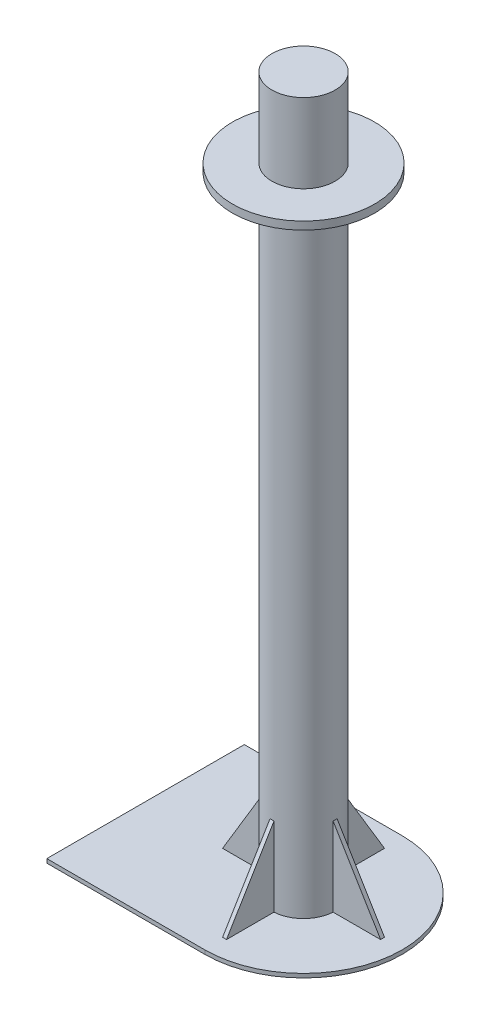
ISO-10303-21;
HEADER;
FILE_DESCRIPTION(('STEP AP214'),'2;1');
FILE_NAME('part.step','',(''),(''),'','','');
FILE_SCHEMA(('AUTOMOTIVE_DESIGN { 1 0 10303 214 1 1 1 1 }'));
ENDSEC;
DATA;
#1=APPLICATION_CONTEXT('core data for automotive mechanical design processes');
#2=APPLICATION_PROTOCOL_DEFINITION('international standard','automotive_design',2000,#1);
#3=PRODUCT_CONTEXT('',#1,'mechanical');
#4=PRODUCT('Part','Part','',(#3));
#5=PRODUCT_RELATED_PRODUCT_CATEGORY('part','',(#4));
#6=PRODUCT_DEFINITION_FORMATION('','',#4);
#7=PRODUCT_DEFINITION_CONTEXT('part definition',#1,'design');
#8=PRODUCT_DEFINITION('design','',#6,#7);
#9=PRODUCT_DEFINITION_SHAPE('','',#8);
#10=(LENGTH_UNIT() NAMED_UNIT(*) SI_UNIT(.MILLI.,.METRE.));
#11=(NAMED_UNIT(*) PLANE_ANGLE_UNIT() SI_UNIT($,.RADIAN.));
#12=(NAMED_UNIT(*) SI_UNIT($,.STERADIAN.) SOLID_ANGLE_UNIT());
#13=UNCERTAINTY_MEASURE_WITH_UNIT(LENGTH_MEASURE(1.E-05),#10,'distance_accuracy_value','');
#14=(GEOMETRIC_REPRESENTATION_CONTEXT(3) GLOBAL_UNCERTAINTY_ASSIGNED_CONTEXT((#13)) GLOBAL_UNIT_ASSIGNED_CONTEXT((#10,
#11,#12)) REPRESENTATION_CONTEXT('',''));
#15=CARTESIAN_POINT('',(0.,0.,0.));
#16=DIRECTION('',(0.,0.,1.));
#17=DIRECTION('',(1.,0.,0.));
#18=AXIS2_PLACEMENT_3D('',#15,#16,#17);
#19=CARTESIAN_POINT('',(99.9999999999998,805.,0.));
#20=DIRECTION('',(0.,1.,0.));
#21=DIRECTION('',(0.,0.,1.));
#22=AXIS2_PLACEMENT_3D('',#19,#20,#21);
#23=PLANE('',#22);
#24=CARTESIAN_POINT('',(99.9999999999998,805.,0.));
#25=DIRECTION('',(0.,1.,0.));
#26=DIRECTION('',(0.,0.,1.));
#27=AXIS2_PLACEMENT_3D('',#24,#25,#26);
#28=CIRCLE('',#27,90.);
#29=CARTESIAN_POINT('',(99.9999999999998,805.,90.));
#30=VERTEX_POINT('',#29);
#31=EDGE_CURVE('E181',#30,#30,#28,.T.);
#32=ORIENTED_EDGE('',*,*,#31,.T.);
#33=EDGE_LOOP('',(#32));
#34=FACE_BOUND('',#33,.T.);
#35=CARTESIAN_POINT('',(99.9999999999994,805.,1.37043154602168E-13));
#36=DIRECTION('',(0.,1.,0.));
#37=DIRECTION('',(0.,0.,1.));
#38=AXIS2_PLACEMENT_3D('',#35,#36,#37);
#39=CIRCLE('',#38,40.);
#40=CARTESIAN_POINT('',(99.9999999999994,805.,40.0000000000001));
#41=VERTEX_POINT('',#40);
#42=EDGE_CURVE('E633',#41,#41,#39,.T.);
#43=ORIENTED_EDGE('',*,*,#42,.F.);
#44=EDGE_LOOP('',(#43));
#45=FACE_BOUND('',#44,.T.);
#46=ADVANCED_FACE('F34',(#34,#45),#23,.T.);
#47=CARTESIAN_POINT('',(100.,5.,0.));
#48=DIRECTION('',(0.,1.,0.));
#49=DIRECTION('',(0.,0.,1.));
#50=AXIS2_PLACEMENT_3D('',#47,#48,#49);
#51=PLANE('',#50);
#52=DIRECTION('',(-1.,0.,0.));
#53=VECTOR('',#52,1.);
#54=CARTESIAN_POINT('',(60.0782014433213,5.,2.50000000000002));
#55=LINE('',#54,#53);
#56=CARTESIAN_POINT('',(60.0782014433213,5.,2.50000000000001));
#57=VERTEX_POINT('',#56);
#58=CARTESIAN_POINT('',(0.,5.,2.50000000000002));
#59=VERTEX_POINT('',#58);
#60=EDGE_CURVE('E265',#57,#59,#55,.T.);
#61=ORIENTED_EDGE('',*,*,#60,.T.);
#62=DIRECTION('',(0.,0.,-1.));
#63=VECTOR('',#62,1.);
#64=CARTESIAN_POINT('',(0.,5.,2.50000000000003));
#65=LINE('',#64,#63);
#66=CARTESIAN_POINT('',(0.,5.,-2.49999999999997));
#67=VERTEX_POINT('',#66);
#68=EDGE_CURVE('E272',#59,#67,#65,.T.);
#69=ORIENTED_EDGE('',*,*,#68,.T.);
#70=DIRECTION('',(1.,0.,0.));
#71=VECTOR('',#70,1.);
#72=CARTESIAN_POINT('',(0.,5.,-2.49999999999997));
#73=LINE('',#72,#71);
#74=CARTESIAN_POINT('',(60.0782014433213,5.,-2.49999999999998));
#75=VERTEX_POINT('',#74);
#76=EDGE_CURVE('E268',#67,#75,#73,.T.);
#77=ORIENTED_EDGE('',*,*,#76,.T.);
#78=CARTESIAN_POINT('',(100.,5.,0.));
#79=DIRECTION('',(0.,1.,0.));
#80=DIRECTION('',(0.,0.,1.));
#81=AXIS2_PLACEMENT_3D('',#78,#79,#80);
#82=CIRCLE('',#81,40.);
#83=CARTESIAN_POINT('',(97.5,5.,-39.9217985566786));
#84=VERTEX_POINT('',#83);
#85=EDGE_CURVE('E367',#84,#75,#82,.T.);
#86=ORIENTED_EDGE('',*,*,#85,.F.);
#87=DIRECTION('',(0.,0.,1.));
#88=VECTOR('',#87,1.);
#89=CARTESIAN_POINT('',(97.5,5.,-100.));
#90=LINE('',#89,#88);
#91=CARTESIAN_POINT('',(97.5,5.,-100.));
#92=VERTEX_POINT('',#91);
#93=EDGE_CURVE('E256',#92,#84,#90,.T.);
#94=ORIENTED_EDGE('',*,*,#93,.F.);
#95=DIRECTION('',(-1.,0.,0.));
#96=VECTOR('',#95,1.);
#97=CARTESIAN_POINT('',(102.5,5.,-100.));
#98=LINE('',#97,#96);
#99=CARTESIAN_POINT('',(102.5,5.,-100.));
#100=VERTEX_POINT('',#99);
#101=EDGE_CURVE('E258',#100,#92,#98,.T.);
#102=ORIENTED_EDGE('',*,*,#101,.F.);
#103=DIRECTION('',(0.,0.,-1.));
#104=VECTOR('',#103,1.);
#105=CARTESIAN_POINT('',(102.5,5.,-39.9217985566785));
#106=LINE('',#105,#104);
#107=CARTESIAN_POINT('',(102.5,5.,-39.9217985566785));
#108=VERTEX_POINT('',#107);
#109=EDGE_CURVE('E261',#108,#100,#106,.T.);
#110=ORIENTED_EDGE('',*,*,#109,.F.);
#111=CARTESIAN_POINT('',(139.921798556678,5.,-2.49999999999999));
#112=VERTEX_POINT('',#111);
#113=EDGE_CURVE('E280',#112,#108,#82,.T.);
#114=ORIENTED_EDGE('',*,*,#113,.F.);
#115=DIRECTION('',(1.,0.,0.));
#116=VECTOR('',#115,1.);
#117=CARTESIAN_POINT('',(139.921798556678,5.,-2.49999999999999));
#118=LINE('',#117,#116);
#119=CARTESIAN_POINT('',(200.,5.,-2.49999999999999));
#120=VERTEX_POINT('',#119);
#121=EDGE_CURVE('E247',#112,#120,#118,.T.);
#122=ORIENTED_EDGE('',*,*,#121,.T.);
#123=DIRECTION('',(0.,0.,-1.));
#124=VECTOR('',#123,1.);
#125=CARTESIAN_POINT('',(200.,5.,2.5));
#126=LINE('',#125,#124);
#127=CARTESIAN_POINT('',(200.,5.,2.50000000000003));
#128=VERTEX_POINT('',#127);
#129=EDGE_CURVE('E252',#128,#120,#126,.T.);
#130=ORIENTED_EDGE('',*,*,#129,.F.);
#131=DIRECTION('',(-1.,0.,0.));
#132=VECTOR('',#131,1.);
#133=CARTESIAN_POINT('',(200.,5.,2.5));
#134=LINE('',#133,#132);
#135=CARTESIAN_POINT('',(139.921798556678,5.,2.50000000000001));
#136=VERTEX_POINT('',#135);
#137=EDGE_CURVE('E218',#128,#136,#134,.T.);
#138=ORIENTED_EDGE('',*,*,#137,.T.);
#139=CARTESIAN_POINT('',(102.5,5.,39.9217985566784));
#140=VERTEX_POINT('',#139);
#141=EDGE_CURVE('E277',#140,#136,#82,.T.);
#142=ORIENTED_EDGE('',*,*,#141,.F.);
#143=DIRECTION('',(0.,0.,-1.));
#144=VECTOR('',#143,1.);
#145=CARTESIAN_POINT('',(102.5,5.,100.));
#146=LINE('',#145,#144);
#147=CARTESIAN_POINT('',(102.5,5.,100.));
#148=VERTEX_POINT('',#147);
#149=EDGE_CURVE('E192',#148,#140,#146,.T.);
#150=ORIENTED_EDGE('',*,*,#149,.F.);
#151=DIRECTION('',(-1.,0.,0.));
#152=VECTOR('',#151,1.);
#153=CARTESIAN_POINT('',(102.5,5.,100.));
#154=LINE('',#153,#152);
#155=CARTESIAN_POINT('',(97.5,5.,100.));
#156=VERTEX_POINT('',#155);
#157=EDGE_CURVE('E186',#148,#156,#154,.T.);
#158=ORIENTED_EDGE('',*,*,#157,.T.);
#159=DIRECTION('',(0.,0.,1.));
#160=VECTOR('',#159,1.);
#161=CARTESIAN_POINT('',(97.5,5.,39.9217985566785));
#162=LINE('',#161,#160);
#163=CARTESIAN_POINT('',(97.5,5.,39.9217985566785));
#164=VERTEX_POINT('',#163);
#165=EDGE_CURVE('E193',#164,#156,#162,.T.);
#166=ORIENTED_EDGE('',*,*,#165,.F.);
#167=EDGE_CURVE('E195',#57,#164,#82,.T.);
#168=ORIENTED_EDGE('',*,*,#167,.F.);
#169=EDGE_LOOP('',(#61,#69,#77,#86,#94,#102,#110,#114,#122,#130,#138,#142,#150,#158,#166,#168));
#170=FACE_BOUND('',#169,.T.);
#171=DIRECTION('',(0.,0.,1.));
#172=VECTOR('',#171,1.);
#173=CARTESIAN_POINT('',(-100.,5.,125.));
#174=LINE('',#173,#172);
#175=CARTESIAN_POINT('',(-100.,5.,-125.));
#176=VERTEX_POINT('',#175);
#177=CARTESIAN_POINT('',(-100.,5.,125.));
#178=VERTEX_POINT('',#177);
#179=EDGE_CURVE('E281',#176,#178,#174,.T.);
#180=ORIENTED_EDGE('',*,*,#179,.T.);
#181=DIRECTION('',(1.,0.,0.));
#182=VECTOR('',#181,1.);
#183=CARTESIAN_POINT('',(100.,5.,125.));
#184=LINE('',#183,#182);
#185=CARTESIAN_POINT('',(100.,5.,125.));
#186=VERTEX_POINT('',#185);
#187=EDGE_CURVE('E85',#178,#186,#184,.T.);
#188=ORIENTED_EDGE('',*,*,#187,.T.);
#189=CARTESIAN_POINT('',(100.,5.,0.));
#190=DIRECTION('',(0.,1.,0.));
#191=DIRECTION('',(0.,0.,1.));
#192=AXIS2_PLACEMENT_3D('',#189,#190,#191);
#193=CIRCLE('',#192,125.);
#194=CARTESIAN_POINT('',(100.,5.,-125.));
#195=VERTEX_POINT('',#194);
#196=EDGE_CURVE('E284',#186,#195,#193,.T.);
#197=ORIENTED_EDGE('',*,*,#196,.T.);
#198=DIRECTION('',(-1.,0.,0.));
#199=VECTOR('',#198,1.);
#200=CARTESIAN_POINT('',(100.,5.,-125.));
#201=LINE('',#200,#199);
#202=EDGE_CURVE('E53',#195,#176,#201,.T.);
#203=ORIENTED_EDGE('',*,*,#202,.T.);
#204=EDGE_LOOP('',(#180,#188,#197,#203));
#205=FACE_BOUND('',#204,.T.);
#206=ADVANCED_FACE('F365',(#170,#205),#51,.T.);
#207=CARTESIAN_POINT('',(100.,105.,0.));
#208=DIRECTION('',(0.,-1.,0.));
#209=DIRECTION('',(0.,0.,-1.));
#210=AXIS2_PLACEMENT_3D('',#207,#208,#209);
#211=CYLINDRICAL_SURFACE('',#210,40.);
#212=DIRECTION('',(0.,-1.,0.));
#213=VECTOR('',#212,1.);
#214=CARTESIAN_POINT('',(97.5,105.,39.9217985566785));
#215=LINE('',#214,#213);
#216=CARTESIAN_POINT('',(97.4999999999975,105.,39.9217985566785));
#217=VERTEX_POINT('',#216);
#218=EDGE_CURVE('E179',#217,#164,#215,.T.);
#219=ORIENTED_EDGE('',*,*,#218,.F.);
#220=CARTESIAN_POINT('',(99.9999999999998,105.,0.));
#221=DIRECTION('',(0.,1.,0.));
#222=DIRECTION('',(0.,0.,1.));
#223=AXIS2_PLACEMENT_3D('',#220,#221,#222);
#224=CIRCLE('',#223,40.0000000000003);
#225=CARTESIAN_POINT('',(102.500000000002,105.,39.9217985566785));
#226=VERTEX_POINT('',#225);
#227=EDGE_CURVE('E162',#217,#226,#224,.T.);
#228=ORIENTED_EDGE('',*,*,#227,.T.);
#229=DIRECTION('',(0.,-1.,0.));
#230=VECTOR('',#229,1.);
#231=CARTESIAN_POINT('',(102.5,105.,39.9217985566784));
#232=LINE('',#231,#230);
#233=EDGE_CURVE('E176',#226,#140,#232,.T.);
#234=ORIENTED_EDGE('',*,*,#233,.T.);
#235=ORIENTED_EDGE('',*,*,#141,.T.);
#236=DIRECTION('',(0.,-1.,0.));
#237=VECTOR('',#236,1.);
#238=CARTESIAN_POINT('',(139.921798556678,105.,2.50000000000001));
#239=LINE('',#238,#237);
#240=CARTESIAN_POINT('',(139.921798556678,105.,2.50000000000223));
#241=VERTEX_POINT('',#240);
#242=EDGE_CURVE('E239',#241,#136,#239,.T.);
#243=ORIENTED_EDGE('',*,*,#242,.F.);
#244=CARTESIAN_POINT('',(139.921798556678,105.,-2.50000000000218));
#245=VERTEX_POINT('',#244);
#246=EDGE_CURVE('E332',#241,#245,#224,.T.);
#247=ORIENTED_EDGE('',*,*,#246,.T.);
#248=DIRECTION('',(0.,-1.,0.));
#249=VECTOR('',#248,1.);
#250=CARTESIAN_POINT('',(139.921798556678,105.,-2.49999999999999));
#251=LINE('',#250,#249);
#252=EDGE_CURVE('E166',#245,#112,#251,.T.);
#253=ORIENTED_EDGE('',*,*,#252,.T.);
#254=ORIENTED_EDGE('',*,*,#113,.T.);
#255=DIRECTION('',(0.,-1.,0.));
#256=VECTOR('',#255,1.);
#257=CARTESIAN_POINT('',(102.5,105.,-39.9217985566785));
#258=LINE('',#257,#256);
#259=CARTESIAN_POINT('',(102.5,105.,-39.9217985566785));
#260=VERTEX_POINT('',#259);
#261=EDGE_CURVE('E259',#260,#108,#258,.T.);
#262=ORIENTED_EDGE('',*,*,#261,.F.);
#263=CARTESIAN_POINT('',(97.4999999999998,105.,-39.9217985566785));
#264=VERTEX_POINT('',#263);
#265=EDGE_CURVE('E336',#260,#264,#224,.T.);
#266=ORIENTED_EDGE('',*,*,#265,.T.);
#267=DIRECTION('',(0.,-1.,0.));
#268=VECTOR('',#267,1.);
#269=CARTESIAN_POINT('',(97.5,105.,-39.9217985566786));
#270=LINE('',#269,#268);
#271=EDGE_CURVE('E253',#264,#84,#270,.T.);
#272=ORIENTED_EDGE('',*,*,#271,.T.);
#273=ORIENTED_EDGE('',*,*,#85,.T.);
#274=DIRECTION('',(0.,-1.,0.));
#275=VECTOR('',#274,1.);
#276=CARTESIAN_POINT('',(60.0782014433213,105.,-2.49999999999998));
#277=LINE('',#276,#275);
#278=CARTESIAN_POINT('',(60.0782014433213,105.,-2.50000000000026));
#279=VERTEX_POINT('',#278);
#280=EDGE_CURVE('E269',#279,#75,#277,.T.);
#281=ORIENTED_EDGE('',*,*,#280,.F.);
#282=CARTESIAN_POINT('',(60.0782014433213,105.,2.50000000000033));
#283=VERTEX_POINT('',#282);
#284=EDGE_CURVE('E180',#279,#283,#224,.T.);
#285=ORIENTED_EDGE('',*,*,#284,.T.);
#286=DIRECTION('',(0.,-1.,0.));
#287=VECTOR('',#286,1.);
#288=CARTESIAN_POINT('',(60.0782014433213,105.,2.50000000000001));
#289=LINE('',#288,#287);
#290=EDGE_CURVE('E264',#283,#57,#289,.T.);
#291=ORIENTED_EDGE('',*,*,#290,.T.);
#292=ORIENTED_EDGE('',*,*,#167,.T.);
#293=EDGE_LOOP('',(#219,#228,#234,#235,#243,#247,#253,#254,#262,#266,#272,#273,#281,#285,#291,#292));
#294=FACE_BOUND('',#293,.T.);
#295=CARTESIAN_POINT('',(99.9999999999998,795.,0.));
#296=DIRECTION('',(0.,1.,0.));
#297=DIRECTION('',(0.,0.,1.));
#298=AXIS2_PLACEMENT_3D('',#295,#296,#297);
#299=CIRCLE('',#298,40.0000000000003);
#300=CARTESIAN_POINT('',(99.9999999999998,795.,40.0000000000003));
#301=VERTEX_POINT('',#300);
#302=EDGE_CURVE('E330',#301,#301,#299,.T.);
#303=ORIENTED_EDGE('',*,*,#302,.F.);
#304=EDGE_LOOP('',(#303));
#305=FACE_BOUND('',#304,.T.);
#306=ADVANCED_FACE('F172',(#294,#305),#211,.T.);
#307=CARTESIAN_POINT('',(-100.,5.,125.));
#308=DIRECTION('',(1.,0.,0.));
#309=DIRECTION('',(0.,0.,-1.));
#310=AXIS2_PLACEMENT_3D('',#307,#308,#309);
#311=PLANE('',#310);
#312=DIRECTION('',(0.,0.,1.));
#313=VECTOR('',#312,1.);
#314=CARTESIAN_POINT('',(-100.,0.,125.));
#315=LINE('',#314,#313);
#316=CARTESIAN_POINT('',(-100.,0.,-125.));
#317=VERTEX_POINT('',#316);
#318=CARTESIAN_POINT('',(-100.,0.,125.));
#319=VERTEX_POINT('',#318);
#320=EDGE_CURVE('E279',#317,#319,#315,.T.);
#321=ORIENTED_EDGE('',*,*,#320,.T.);
#322=DIRECTION('',(0.,-1.,0.));
#323=VECTOR('',#322,1.);
#324=CARTESIAN_POINT('',(-100.,5.,125.));
#325=LINE('',#324,#323);
#326=EDGE_CURVE('E189',#178,#319,#325,.T.);
#327=ORIENTED_EDGE('',*,*,#326,.F.);
#328=ORIENTED_EDGE('',*,*,#179,.F.);
#329=DIRECTION('',(0.,-1.,0.));
#330=VECTOR('',#329,1.);
#331=CARTESIAN_POINT('',(-100.,5.,-125.));
#332=LINE('',#331,#330);
#333=EDGE_CURVE('E287',#176,#317,#332,.T.);
#334=ORIENTED_EDGE('',*,*,#333,.T.);
#335=EDGE_LOOP('',(#321,#327,#328,#334));
#336=FACE_BOUND('',#335,.T.);
#337=ADVANCED_FACE('F36',(#336),#311,.F.);
#338=CARTESIAN_POINT('',(100.,5.,125.));
#339=DIRECTION('',(0.,0.,-1.));
#340=DIRECTION('',(-1.,0.,0.));
#341=AXIS2_PLACEMENT_3D('',#338,#339,#340);
#342=PLANE('',#341);
#343=DIRECTION('',(1.,0.,0.));
#344=VECTOR('',#343,1.);
#345=CARTESIAN_POINT('',(100.,0.,125.));
#346=LINE('',#345,#344);
#347=CARTESIAN_POINT('',(100.,0.,125.));
#348=VERTEX_POINT('',#347);
#349=EDGE_CURVE('E290',#319,#348,#346,.T.);
#350=ORIENTED_EDGE('',*,*,#349,.T.);
#351=DIRECTION('',(0.,-1.,0.));
#352=VECTOR('',#351,1.);
#353=CARTESIAN_POINT('',(100.,5.,125.));
#354=LINE('',#353,#352);
#355=EDGE_CURVE('E297',#186,#348,#354,.T.);
#356=ORIENTED_EDGE('',*,*,#355,.F.);
#357=ORIENTED_EDGE('',*,*,#187,.F.);
#358=ORIENTED_EDGE('',*,*,#326,.T.);
#359=EDGE_LOOP('',(#350,#356,#357,#358));
#360=FACE_BOUND('',#359,.T.);
#361=ADVANCED_FACE('F554',(#360),#342,.F.);
#362=CARTESIAN_POINT('',(100.,5.,0.));
#363=DIRECTION('',(0.,-1.,0.));
#364=DIRECTION('',(0.,0.,-1.));
#365=AXIS2_PLACEMENT_3D('',#362,#363,#364);
#366=CYLINDRICAL_SURFACE('',#365,125.);
#367=CARTESIAN_POINT('',(100.,0.,0.));
#368=DIRECTION('',(0.,1.,0.));
#369=DIRECTION('',(0.,0.,1.));
#370=AXIS2_PLACEMENT_3D('',#367,#368,#369);
#371=CIRCLE('',#370,125.);
#372=CARTESIAN_POINT('',(100.,0.,-125.));
#373=VERTEX_POINT('',#372);
#374=EDGE_CURVE('E71',#348,#373,#371,.T.);
#375=ORIENTED_EDGE('',*,*,#374,.T.);
#376=DIRECTION('',(0.,-1.,0.));
#377=VECTOR('',#376,1.);
#378=CARTESIAN_POINT('',(100.,5.,-125.));
#379=LINE('',#378,#377);
#380=EDGE_CURVE('E295',#195,#373,#379,.T.);
#381=ORIENTED_EDGE('',*,*,#380,.F.);
#382=ORIENTED_EDGE('',*,*,#196,.F.);
#383=ORIENTED_EDGE('',*,*,#355,.T.);
#384=EDGE_LOOP('',(#375,#381,#382,#383));
#385=FACE_BOUND('',#384,.T.);
#386=ADVANCED_FACE('F545',(#385),#366,.T.);
#387=CARTESIAN_POINT('',(100.,5.,-125.));
#388=DIRECTION('',(0.,0.,1.));
#389=DIRECTION('',(1.,0.,0.));
#390=AXIS2_PLACEMENT_3D('',#387,#388,#389);
#391=PLANE('',#390);
#392=DIRECTION('',(-1.,0.,0.));
#393=VECTOR('',#392,1.);
#394=CARTESIAN_POINT('',(100.,0.,-125.));
#395=LINE('',#394,#393);
#396=EDGE_CURVE('E77',#373,#317,#395,.T.);
#397=ORIENTED_EDGE('',*,*,#396,.T.);
#398=ORIENTED_EDGE('',*,*,#333,.F.);
#399=ORIENTED_EDGE('',*,*,#202,.F.);
#400=ORIENTED_EDGE('',*,*,#380,.T.);
#401=EDGE_LOOP('',(#397,#398,#399,#400));
#402=FACE_BOUND('',#401,.T.);
#403=ADVANCED_FACE('F535',(#402),#391,.F.);
#404=CARTESIAN_POINT('',(100.,0.,0.));
#405=DIRECTION('',(0.,1.,0.));
#406=DIRECTION('',(0.,0.,1.));
#407=AXIS2_PLACEMENT_3D('',#404,#405,#406);
#408=PLANE('',#407);
#409=ORIENTED_EDGE('',*,*,#320,.F.);
#410=ORIENTED_EDGE('',*,*,#396,.F.);
#411=ORIENTED_EDGE('',*,*,#374,.F.);
#412=ORIENTED_EDGE('',*,*,#349,.F.);
#413=EDGE_LOOP('',(#409,#410,#411,#412));
#414=FACE_BOUND('',#413,.T.);
#415=ADVANCED_FACE('F509',(#414),#408,.F.);
#416=CARTESIAN_POINT('',(97.5,105.,39.9217985566785));
#417=DIRECTION('',(1.,0.,0.));
#418=DIRECTION('',(0.,0.,-1.));
#419=AXIS2_PLACEMENT_3D('',#416,#417,#418);
#420=PLANE('',#419);
#421=ORIENTED_EDGE('',*,*,#165,.T.);
#422=DIRECTION('',(0.,-0.857197045611793,0.514988567828854));
#423=VECTOR('',#422,1.);
#424=CARTESIAN_POINT('',(97.5,105.,39.9217985566785));
#425=LINE('',#424,#423);
#426=EDGE_CURVE('E167',#217,#156,#425,.T.);
#427=ORIENTED_EDGE('',*,*,#426,.F.);
#428=ORIENTED_EDGE('',*,*,#218,.T.);
#429=EDGE_LOOP('',(#421,#427,#428));
#430=FACE_BOUND('',#429,.T.);
#431=ADVANCED_FACE('F500',(#430),#420,.F.);
#432=CARTESIAN_POINT('',(102.5,105.,100.));
#433=DIRECTION('',(-1.,0.,0.));
#434=DIRECTION('',(0.,0.,1.));
#435=AXIS2_PLACEMENT_3D('',#432,#433,#434);
#436=PLANE('',#435);
#437=ORIENTED_EDGE('',*,*,#233,.F.);
#438=DIRECTION('',(0.,-0.857197045611793,0.514988567828854));
#439=VECTOR('',#438,1.);
#440=CARTESIAN_POINT('',(102.5,78.4786775005586,55.8553321133258));
#441=LINE('',#440,#439);
#442=EDGE_CURVE('E44',#226,#148,#441,.T.);
#443=ORIENTED_EDGE('',*,*,#442,.T.);
#444=ORIENTED_EDGE('',*,*,#149,.T.);
#445=EDGE_LOOP('',(#437,#443,#444));
#446=FACE_BOUND('',#445,.T.);
#447=ADVANCED_FACE('F191',(#446),#436,.F.);
#448=CARTESIAN_POINT('',(60.0782014433213,105.,2.50000000000002));
#449=DIRECTION('',(0.,0.,1.));
#450=DIRECTION('',(1.,0.,0.));
#451=AXIS2_PLACEMENT_3D('',#448,#449,#450);
#452=PLANE('',#451);
#453=DIRECTION('',(0.514988567828852,0.857197045611794,0.));
#454=VECTOR('',#453,1.);
#455=CARTESIAN_POINT('',(60.0782014433213,105.,2.50000000000002));
#456=LINE('',#455,#454);
#457=EDGE_CURVE('E305',#59,#283,#456,.T.);
#458=ORIENTED_EDGE('',*,*,#457,.F.);
#459=ORIENTED_EDGE('',*,*,#60,.F.);
#460=ORIENTED_EDGE('',*,*,#290,.F.);
#461=EDGE_LOOP('',(#458,#459,#460));
#462=FACE_BOUND('',#461,.T.);
#463=ADVANCED_FACE('F354',(#462),#452,.T.);
#464=CARTESIAN_POINT('',(0.,105.,-2.49999999999997));
#465=DIRECTION('',(0.,0.,-1.));
#466=DIRECTION('',(-1.,0.,0.));
#467=AXIS2_PLACEMENT_3D('',#464,#465,#466);
#468=PLANE('',#467);
#469=DIRECTION('',(-0.514988567828852,-0.857197045611794,0.));
#470=VECTOR('',#469,1.);
#471=CARTESIAN_POINT('',(0.,5.,-2.49999999999997));
#472=LINE('',#471,#470);
#473=EDGE_CURVE('E321',#279,#67,#472,.T.);
#474=ORIENTED_EDGE('',*,*,#473,.F.);
#475=ORIENTED_EDGE('',*,*,#280,.T.);
#476=ORIENTED_EDGE('',*,*,#76,.F.);
#477=EDGE_LOOP('',(#474,#475,#476));
#478=FACE_BOUND('',#477,.T.);
#479=ADVANCED_FACE('F363',(#478),#468,.T.);
#480=CARTESIAN_POINT('',(102.5,105.,-39.9217985566785));
#481=DIRECTION('',(-1.,0.,0.));
#482=DIRECTION('',(0.,0.,1.));
#483=AXIS2_PLACEMENT_3D('',#480,#481,#482);
#484=PLANE('',#483);
#485=ORIENTED_EDGE('',*,*,#109,.T.);
#486=DIRECTION('',(0.,-0.857197045611793,-0.514988567828853));
#487=VECTOR('',#486,1.);
#488=CARTESIAN_POINT('',(102.5,5.,-100.));
#489=LINE('',#488,#487);
#490=EDGE_CURVE('E303',#260,#100,#489,.T.);
#491=ORIENTED_EDGE('',*,*,#490,.F.);
#492=ORIENTED_EDGE('',*,*,#261,.T.);
#493=EDGE_LOOP('',(#485,#491,#492));
#494=FACE_BOUND('',#493,.T.);
#495=ADVANCED_FACE('F372',(#494),#484,.F.);
#496=CARTESIAN_POINT('',(97.5,105.,-100.));
#497=DIRECTION('',(1.,0.,0.));
#498=DIRECTION('',(0.,0.,-1.));
#499=AXIS2_PLACEMENT_3D('',#496,#497,#498);
#500=PLANE('',#499);
#501=ORIENTED_EDGE('',*,*,#271,.F.);
#502=DIRECTION('',(0.,-0.857197045611793,-0.514988567828853));
#503=VECTOR('',#502,1.);
#504=CARTESIAN_POINT('',(97.5,78.4786775005587,-55.8553321133258));
#505=LINE('',#504,#503);
#506=EDGE_CURVE('E11',#264,#92,#505,.T.);
#507=ORIENTED_EDGE('',*,*,#506,.T.);
#508=ORIENTED_EDGE('',*,*,#93,.T.);
#509=EDGE_LOOP('',(#501,#507,#508));
#510=FACE_BOUND('',#509,.T.);
#511=ADVANCED_FACE('F378',(#510),#500,.F.);
#512=CARTESIAN_POINT('',(139.921798556678,105.,-2.49999999999999));
#513=DIRECTION('',(0.,0.,-1.));
#514=DIRECTION('',(-1.,0.,0.));
#515=AXIS2_PLACEMENT_3D('',#512,#513,#514);
#516=PLANE('',#515);
#517=DIRECTION('',(-0.514988567828855,0.857197045611792,0.));
#518=VECTOR('',#517,1.);
#519=CARTESIAN_POINT('',(139.921798556678,105.,-2.49999999999999));
#520=LINE('',#519,#518);
#521=EDGE_CURVE('E208',#120,#245,#520,.T.);
#522=ORIENTED_EDGE('',*,*,#521,.F.);
#523=ORIENTED_EDGE('',*,*,#121,.F.);
#524=ORIENTED_EDGE('',*,*,#252,.F.);
#525=EDGE_LOOP('',(#522,#523,#524));
#526=FACE_BOUND('',#525,.T.);
#527=ADVANCED_FACE('F380',(#526),#516,.T.);
#528=CARTESIAN_POINT('',(200.,105.,2.5));
#529=DIRECTION('',(0.,0.,1.));
#530=DIRECTION('',(1.,0.,0.));
#531=AXIS2_PLACEMENT_3D('',#528,#529,#530);
#532=PLANE('',#531);
#533=DIRECTION('',(0.514988567828855,-0.857197045611792,0.));
#534=VECTOR('',#533,1.);
#535=CARTESIAN_POINT('',(139.921798556678,105.,2.50000000000003));
#536=LINE('',#535,#534);
#537=EDGE_CURVE('E209',#241,#128,#536,.T.);
#538=ORIENTED_EDGE('',*,*,#537,.F.);
#539=ORIENTED_EDGE('',*,*,#242,.T.);
#540=ORIENTED_EDGE('',*,*,#137,.F.);
#541=EDGE_LOOP('',(#538,#539,#540));
#542=FACE_BOUND('',#541,.T.);
#543=ADVANCED_FACE('F386',(#542),#532,.T.);
#544=CARTESIAN_POINT('',(107.5,105.,39.9217985566785));
#545=DIRECTION('',(0.,-0.514988567828854,-0.857197045611793));
#546=DIRECTION('',(0.,0.857197045611793,-0.514988567828854));
#547=AXIS2_PLACEMENT_3D('',#544,#545,#546);
#548=PLANE('',#547);
#549=DIRECTION('',(-1.,0.,0.));
#550=VECTOR('',#549,1.);
#551=CARTESIAN_POINT('',(107.5,105.,39.9217985566785));
#552=LINE('',#551,#550);
#553=EDGE_CURVE('E159',#226,#217,#552,.T.);
#554=ORIENTED_EDGE('',*,*,#553,.T.);
#555=ORIENTED_EDGE('',*,*,#426,.T.);
#556=ORIENTED_EDGE('',*,*,#157,.F.);
#557=ORIENTED_EDGE('',*,*,#442,.F.);
#558=EDGE_LOOP('',(#554,#555,#556,#557));
#559=FACE_BOUND('',#558,.T.);
#560=ADVANCED_FACE('F184',(#559),#548,.F.);
#561=CARTESIAN_POINT('',(139.921798556678,105.,-7.49999999999997));
#562=DIRECTION('',(-0.857197045611792,-0.514988567828855,0.));
#563=DIRECTION('',(0.514988567828855,-0.857197045611792,0.));
#564=AXIS2_PLACEMENT_3D('',#561,#562,#563);
#565=PLANE('',#564);
#566=ORIENTED_EDGE('',*,*,#521,.T.);
#567=DIRECTION('',(0.,0.,1.));
#568=VECTOR('',#567,1.);
#569=CARTESIAN_POINT('',(139.921798556678,105.,-7.49999999999997));
#570=LINE('',#569,#568);
#571=EDGE_CURVE('E204',#245,#241,#570,.T.);
#572=ORIENTED_EDGE('',*,*,#571,.T.);
#573=ORIENTED_EDGE('',*,*,#537,.T.);
#574=ORIENTED_EDGE('',*,*,#129,.T.);
#575=EDGE_LOOP('',(#566,#572,#573,#574));
#576=FACE_BOUND('',#575,.T.);
#577=ADVANCED_FACE('F422',(#576),#565,.F.);
#578=CARTESIAN_POINT('',(92.5,5.,-100.));
#579=DIRECTION('',(0.,-0.514988567828853,0.857197045611793));
#580=DIRECTION('',(0.,-0.857197045611793,-0.514988567828853));
#581=AXIS2_PLACEMENT_3D('',#578,#579,#580);
#582=PLANE('',#581);
#583=DIRECTION('',(1.,0.,0.));
#584=VECTOR('',#583,1.);
#585=CARTESIAN_POINT('',(92.5,105.,-39.9217985566785));
#586=LINE('',#585,#584);
#587=EDGE_CURVE('E300',#264,#260,#586,.T.);
#588=ORIENTED_EDGE('',*,*,#587,.T.);
#589=ORIENTED_EDGE('',*,*,#490,.T.);
#590=ORIENTED_EDGE('',*,*,#101,.T.);
#591=ORIENTED_EDGE('',*,*,#506,.F.);
#592=EDGE_LOOP('',(#588,#589,#590,#591));
#593=FACE_BOUND('',#592,.T.);
#594=ADVANCED_FACE('F375',(#593),#582,.F.);
#595=CARTESIAN_POINT('',(0.,5.,7.50000000000003));
#596=DIRECTION('',(0.857197045611794,-0.514988567828852,0.));
#597=DIRECTION('',(0.514988567828852,0.857197045611794,0.));
#598=AXIS2_PLACEMENT_3D('',#595,#596,#597);
#599=PLANE('',#598);
#600=ORIENTED_EDGE('',*,*,#457,.T.);
#601=DIRECTION('',(0.,0.,-1.));
#602=VECTOR('',#601,1.);
#603=CARTESIAN_POINT('',(60.0782014433213,105.,7.50000000000002));
#604=LINE('',#603,#602);
#605=EDGE_CURVE('E318',#283,#279,#604,.T.);
#606=ORIENTED_EDGE('',*,*,#605,.T.);
#607=ORIENTED_EDGE('',*,*,#473,.T.);
#608=ORIENTED_EDGE('',*,*,#68,.F.);
#609=EDGE_LOOP('',(#600,#606,#607,#608));
#610=FACE_BOUND('',#609,.T.);
#611=ADVANCED_FACE('F350',(#610),#599,.F.);
#612=CARTESIAN_POINT('',(99.9999999999998,105.,0.));
#613=DIRECTION('',(0.,1.,0.));
#614=DIRECTION('',(0.,0.,1.));
#615=AXIS2_PLACEMENT_3D('',#612,#613,#614);
#616=PLANE('',#615);
#617=ORIENTED_EDGE('',*,*,#605,.F.);
#618=ORIENTED_EDGE('',*,*,#284,.F.);
#619=EDGE_LOOP('',(#617,#618));
#620=FACE_BOUND('',#619,.T.);
#621=ADVANCED_FACE('F417',(#620),#616,.F.);
#622=ORIENTED_EDGE('',*,*,#553,.F.);
#623=ORIENTED_EDGE('',*,*,#227,.F.);
#624=EDGE_LOOP('',(#622,#623));
#625=FACE_BOUND('',#624,.T.);
#626=ADVANCED_FACE('F161',(#625),#616,.F.);
#627=ORIENTED_EDGE('',*,*,#571,.F.);
#628=ORIENTED_EDGE('',*,*,#246,.F.);
#629=EDGE_LOOP('',(#627,#628));
#630=FACE_BOUND('',#629,.T.);
#631=ADVANCED_FACE('F415',(#630),#616,.F.);
#632=ORIENTED_EDGE('',*,*,#587,.F.);
#633=ORIENTED_EDGE('',*,*,#265,.F.);
#634=EDGE_LOOP('',(#632,#633));
#635=FACE_BOUND('',#634,.T.);
#636=ADVANCED_FACE('F408',(#635),#616,.F.);
#637=CARTESIAN_POINT('',(99.9999999999998,795.,0.));
#638=DIRECTION('',(0.,1.,0.));
#639=DIRECTION('',(0.,0.,1.));
#640=AXIS2_PLACEMENT_3D('',#637,#638,#639);
#641=PLANE('',#640);
#642=CARTESIAN_POINT('',(99.9999999999998,795.,0.));
#643=DIRECTION('',(0.,1.,0.));
#644=DIRECTION('',(0.,0.,1.));
#645=AXIS2_PLACEMENT_3D('',#642,#643,#644);
#646=CIRCLE('',#645,90.);
#647=CARTESIAN_POINT('',(99.9999999999998,795.,90.));
#648=VERTEX_POINT('',#647);
#649=EDGE_CURVE('E632',#648,#648,#646,.T.);
#650=ORIENTED_EDGE('',*,*,#649,.F.);
#651=EDGE_LOOP('',(#650));
#652=FACE_BOUND('',#651,.T.);
#653=ORIENTED_EDGE('',*,*,#302,.T.);
#654=EDGE_LOOP('',(#653));
#655=FACE_BOUND('',#654,.T.);
#656=ADVANCED_FACE('F404',(#652,#655),#641,.F.);
#657=CARTESIAN_POINT('',(99.9999999999998,805.,0.));
#658=DIRECTION('',(0.,-1.,0.));
#659=DIRECTION('',(0.,0.,-1.));
#660=AXIS2_PLACEMENT_3D('',#657,#658,#659);
#661=CYLINDRICAL_SURFACE('',#660,90.);
#662=ORIENTED_EDGE('',*,*,#31,.F.);
#663=EDGE_LOOP('',(#662));
#664=FACE_BOUND('',#663,.T.);
#665=ORIENTED_EDGE('',*,*,#649,.T.);
#666=EDGE_LOOP('',(#665));
#667=FACE_BOUND('',#666,.T.);
#668=ADVANCED_FACE('F407',(#664,#667),#661,.T.);
#669=CARTESIAN_POINT('',(99.9999999999994,905.,1.37043154602168E-13));
#670=DIRECTION('',(0.,-1.,0.));
#671=DIRECTION('',(0.,0.,-1.));
#672=AXIS2_PLACEMENT_3D('',#669,#670,#671);
#673=CYLINDRICAL_SURFACE('',#672,40.);
#674=CARTESIAN_POINT('',(99.9999999999994,905.,1.37043154602168E-13));
#675=DIRECTION('',(0.,1.,0.));
#676=DIRECTION('',(0.,0.,1.));
#677=AXIS2_PLACEMENT_3D('',#674,#675,#676);
#678=CIRCLE('',#677,40.);
#679=CARTESIAN_POINT('',(99.9999999999994,905.,40.0000000000001));
#680=VERTEX_POINT('',#679);
#681=EDGE_CURVE('E631',#680,#680,#678,.T.);
#682=ORIENTED_EDGE('',*,*,#681,.F.);
#683=EDGE_LOOP('',(#682));
#684=FACE_BOUND('',#683,.T.);
#685=ORIENTED_EDGE('',*,*,#42,.T.);
#686=EDGE_LOOP('',(#685));
#687=FACE_BOUND('',#686,.T.);
#688=ADVANCED_FACE('F402',(#684,#687),#673,.T.);
#689=CARTESIAN_POINT('',(99.9999999999994,905.,1.37043154602168E-13));
#690=DIRECTION('',(0.,1.,0.));
#691=DIRECTION('',(0.,0.,1.));
#692=AXIS2_PLACEMENT_3D('',#689,#690,#691);
#693=PLANE('',#692);
#694=ORIENTED_EDGE('',*,*,#681,.T.);
#695=EDGE_LOOP('',(#694));
#696=FACE_BOUND('',#695,.T.);
#697=ADVANCED_FACE('F615',(#696),#693,.T.);
#698=CLOSED_SHELL('',(#46,#206,#306,#337,#361,#386,#403,#415,#431,#447,#463,#479,#495,#511,#527,
#543,#560,#577,#594,#611,#621,#626,#631,#636,#656,#668,#688,#697));
#699=MANIFOLD_SOLID_BREP('B2',#698);
#700=ADVANCED_BREP_SHAPE_REPRESENTATION('',(#18,#699),#14);
#701=SHAPE_DEFINITION_REPRESENTATION(#9,#700);
ENDSEC;
END-ISO-10303-21;
